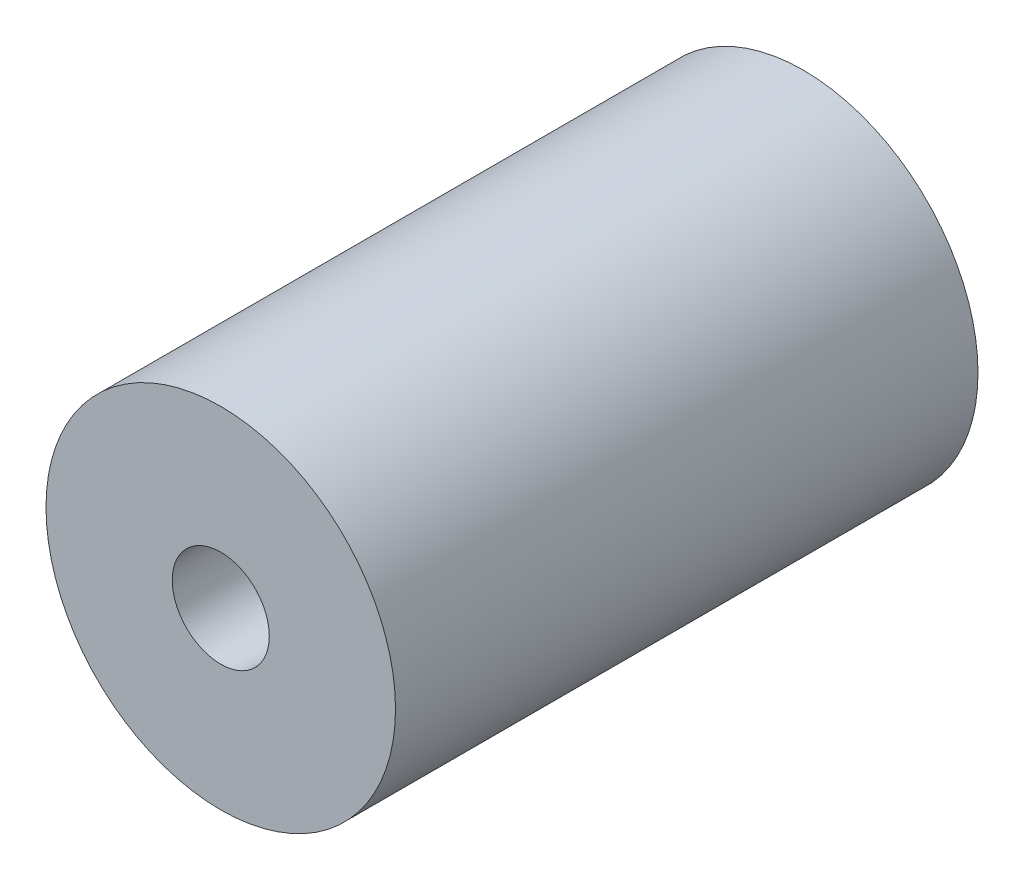
ISO-10303-21;
HEADER;
FILE_DESCRIPTION(('STEP AP214'),'2;1');
FILE_NAME('part.step','',(''),(''),'','','');
FILE_SCHEMA(('AUTOMOTIVE_DESIGN { 1 0 10303 214 1 1 1 1 }'));
ENDSEC;
DATA;
#1=APPLICATION_CONTEXT('core data for automotive mechanical design processes');
#2=APPLICATION_PROTOCOL_DEFINITION('international standard','automotive_design',2000,#1);
#3=PRODUCT_CONTEXT('',#1,'mechanical');
#4=PRODUCT('Part','Part','',(#3));
#5=PRODUCT_RELATED_PRODUCT_CATEGORY('part','',(#4));
#6=PRODUCT_DEFINITION_FORMATION('','',#4);
#7=PRODUCT_DEFINITION_CONTEXT('part definition',#1,'design');
#8=PRODUCT_DEFINITION('design','',#6,#7);
#9=PRODUCT_DEFINITION_SHAPE('','',#8);
#10=(LENGTH_UNIT() NAMED_UNIT(*) SI_UNIT(.MILLI.,.METRE.));
#11=(NAMED_UNIT(*) PLANE_ANGLE_UNIT() SI_UNIT($,.RADIAN.));
#12=(NAMED_UNIT(*) SI_UNIT($,.STERADIAN.) SOLID_ANGLE_UNIT());
#13=UNCERTAINTY_MEASURE_WITH_UNIT(LENGTH_MEASURE(1.E-05),#10,'distance_accuracy_value','');
#14=(GEOMETRIC_REPRESENTATION_CONTEXT(3) GLOBAL_UNCERTAINTY_ASSIGNED_CONTEXT((#13)) GLOBAL_UNIT_ASSIGNED_CONTEXT((#10,
#11,#12)) REPRESENTATION_CONTEXT('',''));
#15=CARTESIAN_POINT('',(0.,0.,0.));
#16=DIRECTION('',(0.,0.,1.));
#17=DIRECTION('',(1.,0.,0.));
#18=AXIS2_PLACEMENT_3D('',#15,#16,#17);
#19=CARTESIAN_POINT('',(10.65,-10.65,-30.));
#20=DIRECTION('',(0.,0.,1.));
#21=DIRECTION('',(1.,0.,0.));
#22=AXIS2_PLACEMENT_3D('',#19,#20,#21);
#23=CYLINDRICAL_SURFACE('',#22,9.);
#24=CARTESIAN_POINT('',(10.65,-10.65,-30.));
#25=DIRECTION('',(0.,0.,1.));
#26=DIRECTION('',(1.,0.,0.));
#27=AXIS2_PLACEMENT_3D('',#24,#25,#26);
#28=CIRCLE('',#27,9.);
#29=CARTESIAN_POINT('',(19.65,-10.65,-30.));
#30=VERTEX_POINT('',#29);
#31=EDGE_CURVE('E10',#30,#30,#28,.T.);
#32=ORIENTED_EDGE('',*,*,#31,.T.);
#33=EDGE_LOOP('',(#32));
#34=FACE_BOUND('',#33,.T.);
#35=CARTESIAN_POINT('',(10.65,-10.65,0.));
#36=DIRECTION('',(0.,0.,1.));
#37=DIRECTION('',(1.,0.,0.));
#38=AXIS2_PLACEMENT_3D('',#35,#36,#37);
#39=CIRCLE('',#38,9.);
#40=CARTESIAN_POINT('',(19.65,-10.65,0.));
#41=VERTEX_POINT('',#40);
#42=EDGE_CURVE('E39',#41,#41,#39,.T.);
#43=ORIENTED_EDGE('',*,*,#42,.F.);
#44=EDGE_LOOP('',(#43));
#45=FACE_BOUND('',#44,.T.);
#46=ADVANCED_FACE('F36',(#34,#45),#23,.T.);
#47=CARTESIAN_POINT('',(10.65,-10.65,-30.));
#48=DIRECTION('',(0.,0.,1.));
#49=DIRECTION('',(1.,0.,0.));
#50=AXIS2_PLACEMENT_3D('',#47,#48,#49);
#51=PLANE('',#50);
#52=CARTESIAN_POINT('',(10.65,-10.65,-30.));
#53=DIRECTION('',(0.,0.,1.));
#54=DIRECTION('',(1.,0.,0.));
#55=AXIS2_PLACEMENT_3D('',#52,#53,#54);
#56=CIRCLE('',#55,2.5);
#57=CARTESIAN_POINT('',(13.15,-10.65,-30.));
#58=VERTEX_POINT('',#57);
#59=EDGE_CURVE('E46',#58,#58,#56,.T.);
#60=ORIENTED_EDGE('',*,*,#59,.T.);
#61=EDGE_LOOP('',(#60));
#62=FACE_BOUND('',#61,.T.);
#63=ORIENTED_EDGE('',*,*,#31,.F.);
#64=EDGE_LOOP('',(#63));
#65=FACE_BOUND('',#64,.T.);
#66=ADVANCED_FACE('F60',(#62,#65),#51,.F.);
#67=CARTESIAN_POINT('',(10.65,-10.65,0.));
#68=DIRECTION('',(0.,0.,1.));
#69=DIRECTION('',(1.,0.,0.));
#70=AXIS2_PLACEMENT_3D('',#67,#68,#69);
#71=PLANE('',#70);
#72=CARTESIAN_POINT('',(10.65,-10.65,0.));
#73=DIRECTION('',(0.,0.,1.));
#74=DIRECTION('',(1.,0.,0.));
#75=AXIS2_PLACEMENT_3D('',#72,#73,#74);
#76=CIRCLE('',#75,2.5);
#77=CARTESIAN_POINT('',(13.15,-10.65,0.));
#78=VERTEX_POINT('',#77);
#79=EDGE_CURVE('E50',#78,#78,#76,.T.);
#80=ORIENTED_EDGE('',*,*,#79,.F.);
#81=EDGE_LOOP('',(#80));
#82=FACE_BOUND('',#81,.T.);
#83=ORIENTED_EDGE('',*,*,#42,.T.);
#84=EDGE_LOOP('',(#83));
#85=FACE_BOUND('',#84,.T.);
#86=ADVANCED_FACE('F57',(#82,#85),#71,.T.);
#87=CARTESIAN_POINT('',(10.65,-10.65,0.));
#88=DIRECTION('',(0.,0.,1.));
#89=DIRECTION('',(1.,0.,0.));
#90=AXIS2_PLACEMENT_3D('',#87,#88,#89);
#91=CYLINDRICAL_SURFACE('',#90,2.5);
#92=ORIENTED_EDGE('',*,*,#79,.T.);
#93=EDGE_LOOP('',(#92));
#94=FACE_BOUND('',#93,.T.);
#95=ORIENTED_EDGE('',*,*,#59,.F.);
#96=EDGE_LOOP('',(#95));
#97=FACE_BOUND('',#96,.T.);
#98=ADVANCED_FACE('F54',(#94,#97),#91,.F.);
#99=CLOSED_SHELL('',(#46,#66,#86,#98));
#100=MANIFOLD_SOLID_BREP('B2',#99);
#101=ADVANCED_BREP_SHAPE_REPRESENTATION('',(#18,#100),#14);
#102=SHAPE_DEFINITION_REPRESENTATION(#9,#101);
ENDSEC;
END-ISO-10303-21;
